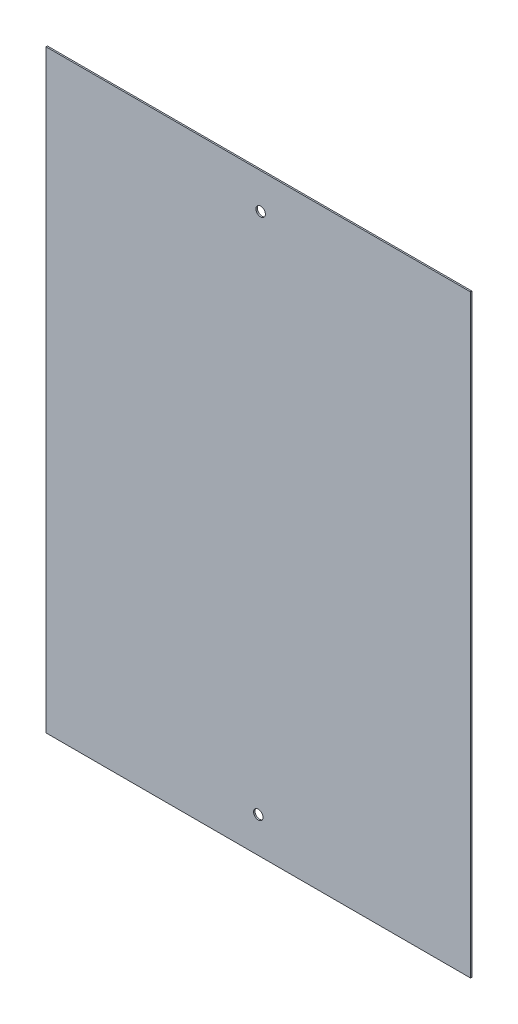
ISO-10303-21;
HEADER;
FILE_DESCRIPTION(('STEP AP214'),'2;1');
FILE_NAME('part.step','',(''),(''),'','','');
FILE_SCHEMA(('AUTOMOTIVE_DESIGN { 1 0 10303 214 1 1 1 1 }'));
ENDSEC;
DATA;
#1=APPLICATION_CONTEXT('core data for automotive mechanical design processes');
#2=APPLICATION_PROTOCOL_DEFINITION('international standard','automotive_design',2000,#1);
#3=PRODUCT_CONTEXT('',#1,'mechanical');
#4=PRODUCT('Part','Part','',(#3));
#5=PRODUCT_RELATED_PRODUCT_CATEGORY('part','',(#4));
#6=PRODUCT_DEFINITION_FORMATION('','',#4);
#7=PRODUCT_DEFINITION_CONTEXT('part definition',#1,'design');
#8=PRODUCT_DEFINITION('design','',#6,#7);
#9=PRODUCT_DEFINITION_SHAPE('','',#8);
#10=(LENGTH_UNIT() NAMED_UNIT(*) SI_UNIT(.MILLI.,.METRE.));
#11=(NAMED_UNIT(*) PLANE_ANGLE_UNIT() SI_UNIT($,.RADIAN.));
#12=(NAMED_UNIT(*) SI_UNIT($,.STERADIAN.) SOLID_ANGLE_UNIT());
#13=UNCERTAINTY_MEASURE_WITH_UNIT(LENGTH_MEASURE(1.E-05),#10,'distance_accuracy_value','');
#14=(GEOMETRIC_REPRESENTATION_CONTEXT(3) GLOBAL_UNCERTAINTY_ASSIGNED_CONTEXT((#13)) GLOBAL_UNIT_ASSIGNED_CONTEXT((#10,
#11,#12)) REPRESENTATION_CONTEXT('',''));
#15=CARTESIAN_POINT('',(0.,0.,0.));
#16=DIRECTION('',(0.,0.,1.));
#17=DIRECTION('',(1.,0.,0.));
#18=AXIS2_PLACEMENT_3D('',#15,#16,#17);
#19=CARTESIAN_POINT('',(90.2309717178718,-125.884049409237,-0.6));
#20=DIRECTION('',(1.,0.,0.));
#21=DIRECTION('',(0.,0.,-1.));
#22=AXIS2_PLACEMENT_3D('',#19,#20,#21);
#23=PLANE('',#22);
#24=DIRECTION('',(0.,1.,0.));
#25=VECTOR('',#24,1.);
#26=CARTESIAN_POINT('',(90.2309717178718,-125.884049409237,0.));
#27=LINE('',#26,#25);
#28=CARTESIAN_POINT('',(90.2309717178718,-125.884049409237,0.));
#29=VERTEX_POINT('',#28);
#30=CARTESIAN_POINT('',(90.2309717178718,126.115950590763,0.));
#31=VERTEX_POINT('',#30);
#32=EDGE_CURVE('E54',#29,#31,#27,.T.);
#33=ORIENTED_EDGE('',*,*,#32,.F.);
#34=DIRECTION('',(0.,0.,1.));
#35=VECTOR('',#34,1.);
#36=CARTESIAN_POINT('',(90.2309717178718,-125.884049409237,-0.6));
#37=LINE('',#36,#35);
#38=CARTESIAN_POINT('',(90.2309717178718,-125.884049409237,-0.6));
#39=VERTEX_POINT('',#38);
#40=EDGE_CURVE('E90',#39,#29,#37,.T.);
#41=ORIENTED_EDGE('',*,*,#40,.F.);
#42=DIRECTION('',(0.,1.,0.));
#43=VECTOR('',#42,1.);
#44=CARTESIAN_POINT('',(90.2309717178718,-125.884049409237,-0.6));
#45=LINE('',#44,#43);
#46=CARTESIAN_POINT('',(90.2309717178718,126.115950590763,-0.6));
#47=VERTEX_POINT('',#46);
#48=EDGE_CURVE('E61',#39,#47,#45,.T.);
#49=ORIENTED_EDGE('',*,*,#48,.T.);
#50=DIRECTION('',(0.,0.,-1.));
#51=VECTOR('',#50,1.);
#52=CARTESIAN_POINT('',(90.2309717178718,126.115950590763,-0.6));
#53=LINE('',#52,#51);
#54=EDGE_CURVE('E11',#47,#31,#53,.F.);
#55=ORIENTED_EDGE('',*,*,#54,.T.);
#56=EDGE_LOOP('',(#33,#41,#49,#55));
#57=FACE_BOUND('',#56,.T.);
#58=ADVANCED_FACE('F39',(#57),#23,.T.);
#59=CARTESIAN_POINT('',(-89.7690282821282,-125.884049409237,-0.6));
#60=DIRECTION('',(0.,-1.,0.));
#61=DIRECTION('',(0.,0.,-1.));
#62=AXIS2_PLACEMENT_3D('',#59,#60,#61);
#63=PLANE('',#62);
#64=DIRECTION('',(1.,0.,0.));
#65=VECTOR('',#64,1.);
#66=CARTESIAN_POINT('',(-89.7690282821282,-125.884049409237,0.));
#67=LINE('',#66,#65);
#68=CARTESIAN_POINT('',(-89.7690282821282,-125.884049409237,0.));
#69=VERTEX_POINT('',#68);
#70=EDGE_CURVE('E85',#69,#29,#67,.T.);
#71=ORIENTED_EDGE('',*,*,#70,.F.);
#72=DIRECTION('',(0.,0.,1.));
#73=VECTOR('',#72,1.);
#74=CARTESIAN_POINT('',(-89.7690282821282,-125.884049409237,-0.6));
#75=LINE('',#74,#73);
#76=CARTESIAN_POINT('',(-89.7690282821282,-125.884049409237,-0.6));
#77=VERTEX_POINT('',#76);
#78=EDGE_CURVE('E81',#77,#69,#75,.T.);
#79=ORIENTED_EDGE('',*,*,#78,.F.);
#80=DIRECTION('',(1.,0.,0.));
#81=VECTOR('',#80,1.);
#82=CARTESIAN_POINT('',(-89.7690282821282,-125.884049409237,-0.6));
#83=LINE('',#82,#81);
#84=EDGE_CURVE('E84',#77,#39,#83,.T.);
#85=ORIENTED_EDGE('',*,*,#84,.T.);
#86=ORIENTED_EDGE('',*,*,#40,.T.);
#87=EDGE_LOOP('',(#71,#79,#85,#86));
#88=FACE_BOUND('',#87,.T.);
#89=ADVANCED_FACE('F83',(#88),#63,.T.);
#90=CARTESIAN_POINT('',(-89.7690282821282,59.1159505907618,-0.6));
#91=DIRECTION('',(-1.,0.,0.));
#92=DIRECTION('',(0.,0.,1.));
#93=AXIS2_PLACEMENT_3D('',#90,#91,#92);
#94=PLANE('',#93);
#95=DIRECTION('',(0.,-1.,0.));
#96=VECTOR('',#95,1.);
#97=CARTESIAN_POINT('',(-89.7690282821282,59.1159505907618,0.));
#98=LINE('',#97,#96);
#99=CARTESIAN_POINT('',(-89.7690282821282,126.115950590763,0.));
#100=VERTEX_POINT('',#99);
#101=EDGE_CURVE('E109',#100,#69,#98,.T.);
#102=ORIENTED_EDGE('',*,*,#101,.F.);
#103=DIRECTION('',(0.,0.,-1.));
#104=VECTOR('',#103,1.);
#105=CARTESIAN_POINT('',(-89.7690282821282,126.115950590763,-0.6));
#106=LINE('',#105,#104);
#107=CARTESIAN_POINT('',(-89.7690282821282,126.115950590763,-0.6));
#108=VERTEX_POINT('',#107);
#109=EDGE_CURVE('E47',#108,#100,#106,.F.);
#110=ORIENTED_EDGE('',*,*,#109,.F.);
#111=DIRECTION('',(0.,-1.,0.));
#112=VECTOR('',#111,1.);
#113=CARTESIAN_POINT('',(-89.7690282821282,59.1159505907618,-0.6));
#114=LINE('',#113,#112);
#115=EDGE_CURVE('E96',#108,#77,#114,.T.);
#116=ORIENTED_EDGE('',*,*,#115,.T.);
#117=ORIENTED_EDGE('',*,*,#78,.T.);
#118=EDGE_LOOP('',(#102,#110,#116,#117));
#119=FACE_BOUND('',#118,.T.);
#120=ADVANCED_FACE('F99',(#119),#94,.T.);
#121=CARTESIAN_POINT('',(80.230971717872,126.115950590763,-0.6));
#122=DIRECTION('',(0.,1.,0.));
#123=DIRECTION('',(0.,0.,1.));
#124=AXIS2_PLACEMENT_3D('',#121,#122,#123);
#125=PLANE('',#124);
#126=DIRECTION('',(-1.,0.,0.));
#127=VECTOR('',#126,1.);
#128=CARTESIAN_POINT('',(80.230971717872,126.115950590763,0.));
#129=LINE('',#128,#127);
#130=EDGE_CURVE('E107',#31,#100,#129,.T.);
#131=ORIENTED_EDGE('',*,*,#130,.F.);
#132=ORIENTED_EDGE('',*,*,#54,.F.);
#133=DIRECTION('',(-1.,0.,0.));
#134=VECTOR('',#133,1.);
#135=CARTESIAN_POINT('',(80.230971717872,126.115950590763,-0.6));
#136=LINE('',#135,#134);
#137=EDGE_CURVE('E101',#47,#108,#136,.T.);
#138=ORIENTED_EDGE('',*,*,#137,.T.);
#139=ORIENTED_EDGE('',*,*,#109,.T.);
#140=EDGE_LOOP('',(#131,#132,#138,#139));
#141=FACE_BOUND('',#140,.T.);
#142=ADVANCED_FACE('F41',(#141),#125,.T.);
#143=CARTESIAN_POINT('',(0.,0.,-0.6));
#144=DIRECTION('',(0.,0.,1.));
#145=DIRECTION('',(1.,0.,0.));
#146=AXIS2_PLACEMENT_3D('',#143,#144,#145);
#147=PLANE('',#146);
#148=ORIENTED_EDGE('',*,*,#115,.F.);
#149=ORIENTED_EDGE('',*,*,#137,.F.);
#150=ORIENTED_EDGE('',*,*,#48,.F.);
#151=ORIENTED_EDGE('',*,*,#84,.F.);
#152=EDGE_LOOP('',(#148,#149,#150,#151));
#153=FACE_BOUND('',#152,.T.);
#154=CARTESIAN_POINT('',(0.230971717871828,-110.884049409237,-0.6));
#155=DIRECTION('',(0.,0.,1.));
#156=DIRECTION('',(1.,0.,0.));
#157=AXIS2_PLACEMENT_3D('',#154,#155,#156);
#158=CIRCLE('',#157,2.);
#159=CARTESIAN_POINT('',(2.23097171787183,-110.884049409237,-0.6));
#160=VERTEX_POINT('',#159);
#161=EDGE_CURVE('E129',#160,#160,#158,.T.);
#162=ORIENTED_EDGE('',*,*,#161,.T.);
#163=EDGE_LOOP('',(#162));
#164=FACE_BOUND('',#163,.T.);
#165=CARTESIAN_POINT('',(1.24782761006627,111.115950590763,-0.6));
#166=DIRECTION('',(0.,0.,1.));
#167=DIRECTION('',(1.,0.,0.));
#168=AXIS2_PLACEMENT_3D('',#165,#166,#167);
#169=CIRCLE('',#168,2.);
#170=CARTESIAN_POINT('',(3.24782761006627,111.115950590763,-0.6));
#171=VERTEX_POINT('',#170);
#172=EDGE_CURVE('E110',#171,#171,#169,.T.);
#173=ORIENTED_EDGE('',*,*,#172,.T.);
#174=EDGE_LOOP('',(#173));
#175=FACE_BOUND('',#174,.T.);
#176=ADVANCED_FACE('F94',(#153,#164,#175),#147,.F.);
#177=CARTESIAN_POINT('',(0.,0.,0.));
#178=DIRECTION('',(0.,0.,1.));
#179=DIRECTION('',(1.,0.,0.));
#180=AXIS2_PLACEMENT_3D('',#177,#178,#179);
#181=PLANE('',#180);
#182=ORIENTED_EDGE('',*,*,#130,.T.);
#183=ORIENTED_EDGE('',*,*,#101,.T.);
#184=ORIENTED_EDGE('',*,*,#70,.T.);
#185=ORIENTED_EDGE('',*,*,#32,.T.);
#186=EDGE_LOOP('',(#182,#183,#184,#185));
#187=FACE_BOUND('',#186,.T.);
#188=CARTESIAN_POINT('',(0.230971717871828,-110.884049409237,0.));
#189=DIRECTION('',(0.,0.,1.));
#190=DIRECTION('',(1.,0.,0.));
#191=AXIS2_PLACEMENT_3D('',#188,#189,#190);
#192=CIRCLE('',#191,2.);
#193=CARTESIAN_POINT('',(2.23097171787183,-110.884049409237,0.));
#194=VERTEX_POINT('',#193);
#195=EDGE_CURVE('E124',#194,#194,#192,.T.);
#196=ORIENTED_EDGE('',*,*,#195,.F.);
#197=EDGE_LOOP('',(#196));
#198=FACE_BOUND('',#197,.T.);
#199=CARTESIAN_POINT('',(1.24782761006627,111.115950590763,0.));
#200=DIRECTION('',(0.,0.,1.));
#201=DIRECTION('',(1.,0.,0.));
#202=AXIS2_PLACEMENT_3D('',#199,#200,#201);
#203=CIRCLE('',#202,2.);
#204=CARTESIAN_POINT('',(3.24782761006627,111.115950590763,0.));
#205=VERTEX_POINT('',#204);
#206=EDGE_CURVE('E127',#205,#205,#203,.T.);
#207=ORIENTED_EDGE('',*,*,#206,.F.);
#208=EDGE_LOOP('',(#207));
#209=FACE_BOUND('',#208,.T.);
#210=ADVANCED_FACE('F116',(#187,#198,#209),#181,.T.);
#211=CARTESIAN_POINT('',(1.24782761006627,111.115950590763,-0.6));
#212=DIRECTION('',(0.,0.,1.));
#213=DIRECTION('',(1.,0.,0.));
#214=AXIS2_PLACEMENT_3D('',#211,#212,#213);
#215=CYLINDRICAL_SURFACE('',#214,2.);
#216=ORIENTED_EDGE('',*,*,#172,.F.);
#217=EDGE_LOOP('',(#216));
#218=FACE_BOUND('',#217,.T.);
#219=ORIENTED_EDGE('',*,*,#206,.T.);
#220=EDGE_LOOP('',(#219));
#221=FACE_BOUND('',#220,.T.);
#222=ADVANCED_FACE('F119',(#218,#221),#215,.F.);
#223=CARTESIAN_POINT('',(0.230971717871828,-110.884049409237,-0.6));
#224=DIRECTION('',(0.,0.,1.));
#225=DIRECTION('',(1.,0.,0.));
#226=AXIS2_PLACEMENT_3D('',#223,#224,#225);
#227=CYLINDRICAL_SURFACE('',#226,2.);
#228=ORIENTED_EDGE('',*,*,#161,.F.);
#229=EDGE_LOOP('',(#228));
#230=FACE_BOUND('',#229,.T.);
#231=ORIENTED_EDGE('',*,*,#195,.T.);
#232=EDGE_LOOP('',(#231));
#233=FACE_BOUND('',#232,.T.);
#234=ADVANCED_FACE('F136',(#230,#233),#227,.F.);
#235=CLOSED_SHELL('',(#58,#89,#120,#142,#176,#210,#222,#234));
#236=MANIFOLD_SOLID_BREP('B2',#235);
#237=ADVANCED_BREP_SHAPE_REPRESENTATION('',(#18,#236),#14);
#238=SHAPE_DEFINITION_REPRESENTATION(#9,#237);
ENDSEC;
END-ISO-10303-21;
